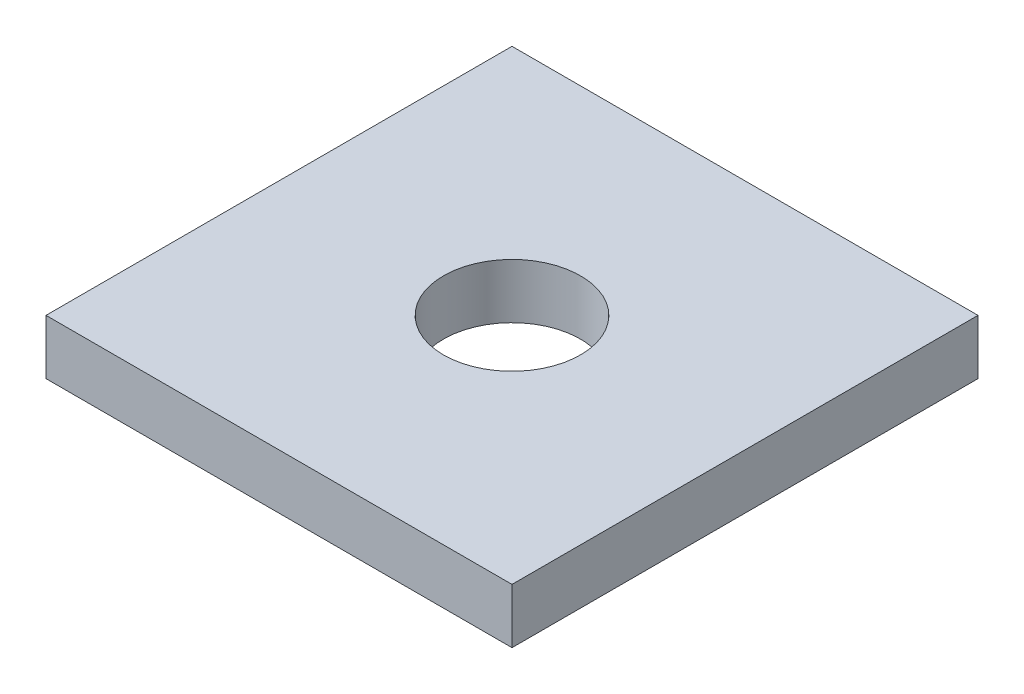
ISO-10303-21;
HEADER;
FILE_DESCRIPTION(('STEP AP214'),'2;1');
FILE_NAME('part.step','',(''),(''),'','','');
FILE_SCHEMA(('AUTOMOTIVE_DESIGN { 1 0 10303 214 1 1 1 1 }'));
ENDSEC;
DATA;
#1=APPLICATION_CONTEXT('core data for automotive mechanical design processes');
#2=APPLICATION_PROTOCOL_DEFINITION('international standard','automotive_design',2000,#1);
#3=PRODUCT_CONTEXT('',#1,'mechanical');
#4=PRODUCT('Part','Part','',(#3));
#5=PRODUCT_RELATED_PRODUCT_CATEGORY('part','',(#4));
#6=PRODUCT_DEFINITION_FORMATION('','',#4);
#7=PRODUCT_DEFINITION_CONTEXT('part definition',#1,'design');
#8=PRODUCT_DEFINITION('design','',#6,#7);
#9=PRODUCT_DEFINITION_SHAPE('','',#8);
#10=(LENGTH_UNIT() NAMED_UNIT(*) SI_UNIT(.MILLI.,.METRE.));
#11=(NAMED_UNIT(*) PLANE_ANGLE_UNIT() SI_UNIT($,.RADIAN.));
#12=(NAMED_UNIT(*) SI_UNIT($,.STERADIAN.) SOLID_ANGLE_UNIT());
#13=UNCERTAINTY_MEASURE_WITH_UNIT(LENGTH_MEASURE(1.E-05),#10,'distance_accuracy_value','');
#14=(GEOMETRIC_REPRESENTATION_CONTEXT(3) GLOBAL_UNCERTAINTY_ASSIGNED_CONTEXT((#13)) GLOBAL_UNIT_ASSIGNED_CONTEXT((#10,
#11,#12)) REPRESENTATION_CONTEXT('',''));
#15=CARTESIAN_POINT('',(0.,0.,0.));
#16=DIRECTION('',(0.,0.,1.));
#17=DIRECTION('',(1.,0.,0.));
#18=AXIS2_PLACEMENT_3D('',#15,#16,#17);
#19=CARTESIAN_POINT('',(170.,40.,-170.));
#20=DIRECTION('',(1.,0.,0.));
#21=DIRECTION('',(0.,0.,-1.));
#22=AXIS2_PLACEMENT_3D('',#19,#20,#21);
#23=PLANE('',#22);
#24=DIRECTION('',(0.,0.,1.));
#25=VECTOR('',#24,1.);
#26=CARTESIAN_POINT('',(170.,0.,-170.));
#27=LINE('',#26,#25);
#28=CARTESIAN_POINT('',(170.,0.,-170.));
#29=VERTEX_POINT('',#28);
#30=CARTESIAN_POINT('',(170.,0.,170.));
#31=VERTEX_POINT('',#30);
#32=EDGE_CURVE('E99',#29,#31,#27,.T.);
#33=ORIENTED_EDGE('',*,*,#32,.F.);
#34=DIRECTION('',(0.,-1.,0.));
#35=VECTOR('',#34,1.);
#36=CARTESIAN_POINT('',(170.,40.,-170.));
#37=LINE('',#36,#35);
#38=CARTESIAN_POINT('',(170.,40.,-170.));
#39=VERTEX_POINT('',#38);
#40=EDGE_CURVE('E11',#39,#29,#37,.T.);
#41=ORIENTED_EDGE('',*,*,#40,.F.);
#42=DIRECTION('',(0.,0.,1.));
#43=VECTOR('',#42,1.);
#44=CARTESIAN_POINT('',(170.,40.,-170.));
#45=LINE('',#44,#43);
#46=CARTESIAN_POINT('',(170.,40.,170.));
#47=VERTEX_POINT('',#46);
#48=EDGE_CURVE('E93',#39,#47,#45,.T.);
#49=ORIENTED_EDGE('',*,*,#48,.T.);
#50=DIRECTION('',(0.,-1.,0.));
#51=VECTOR('',#50,1.);
#52=CARTESIAN_POINT('',(170.,40.,170.));
#53=LINE('',#52,#51);
#54=EDGE_CURVE('E36',#47,#31,#53,.T.);
#55=ORIENTED_EDGE('',*,*,#54,.T.);
#56=EDGE_LOOP('',(#33,#41,#49,#55));
#57=FACE_BOUND('',#56,.T.);
#58=ADVANCED_FACE('F33',(#57),#23,.T.);
#59=CARTESIAN_POINT('',(170.,40.,-170.));
#60=DIRECTION('',(0.,0.,1.));
#61=DIRECTION('',(1.,0.,0.));
#62=AXIS2_PLACEMENT_3D('',#59,#60,#61);
#63=PLANE('',#62);
#64=DIRECTION('',(-1.,0.,0.));
#65=VECTOR('',#64,1.);
#66=CARTESIAN_POINT('',(170.,0.,-170.));
#67=LINE('',#66,#65);
#68=CARTESIAN_POINT('',(-170.,0.,-170.));
#69=VERTEX_POINT('',#68);
#70=EDGE_CURVE('E66',#29,#69,#67,.T.);
#71=ORIENTED_EDGE('',*,*,#70,.T.);
#72=DIRECTION('',(0.,-1.,0.));
#73=VECTOR('',#72,1.);
#74=CARTESIAN_POINT('',(-170.,40.,-170.));
#75=LINE('',#74,#73);
#76=CARTESIAN_POINT('',(-170.,40.,-170.));
#77=VERTEX_POINT('',#76);
#78=EDGE_CURVE('E42',#77,#69,#75,.T.);
#79=ORIENTED_EDGE('',*,*,#78,.F.);
#80=DIRECTION('',(-1.,0.,0.));
#81=VECTOR('',#80,1.);
#82=CARTESIAN_POINT('',(170.,40.,-170.));
#83=LINE('',#82,#81);
#84=EDGE_CURVE('E83',#39,#77,#83,.T.);
#85=ORIENTED_EDGE('',*,*,#84,.F.);
#86=ORIENTED_EDGE('',*,*,#40,.T.);
#87=EDGE_LOOP('',(#71,#79,#85,#86));
#88=FACE_BOUND('',#87,.T.);
#89=ADVANCED_FACE('F110',(#88),#63,.F.);
#90=CARTESIAN_POINT('',(-170.,40.,-170.));
#91=DIRECTION('',(1.,0.,0.));
#92=DIRECTION('',(0.,0.,-1.));
#93=AXIS2_PLACEMENT_3D('',#90,#91,#92);
#94=PLANE('',#93);
#95=DIRECTION('',(0.,0.,1.));
#96=VECTOR('',#95,1.);
#97=CARTESIAN_POINT('',(-170.,0.,-170.));
#98=LINE('',#97,#96);
#99=CARTESIAN_POINT('',(-170.,0.,170.));
#100=VERTEX_POINT('',#99);
#101=EDGE_CURVE('E90',#69,#100,#98,.T.);
#102=ORIENTED_EDGE('',*,*,#101,.T.);
#103=DIRECTION('',(0.,-1.,0.));
#104=VECTOR('',#103,1.);
#105=CARTESIAN_POINT('',(-170.,40.,170.));
#106=LINE('',#105,#104);
#107=CARTESIAN_POINT('',(-170.,40.,170.));
#108=VERTEX_POINT('',#107);
#109=EDGE_CURVE('E87',#108,#100,#106,.T.);
#110=ORIENTED_EDGE('',*,*,#109,.F.);
#111=DIRECTION('',(0.,0.,1.));
#112=VECTOR('',#111,1.);
#113=CARTESIAN_POINT('',(-170.,40.,-170.));
#114=LINE('',#113,#112);
#115=EDGE_CURVE('E78',#77,#108,#114,.T.);
#116=ORIENTED_EDGE('',*,*,#115,.F.);
#117=ORIENTED_EDGE('',*,*,#78,.T.);
#118=EDGE_LOOP('',(#102,#110,#116,#117));
#119=FACE_BOUND('',#118,.T.);
#120=ADVANCED_FACE('F88',(#119),#94,.F.);
#121=CARTESIAN_POINT('',(170.,40.,170.));
#122=DIRECTION('',(0.,0.,1.));
#123=DIRECTION('',(1.,0.,0.));
#124=AXIS2_PLACEMENT_3D('',#121,#122,#123);
#125=PLANE('',#124);
#126=DIRECTION('',(-1.,0.,0.));
#127=VECTOR('',#126,1.);
#128=CARTESIAN_POINT('',(170.,0.,170.));
#129=LINE('',#128,#127);
#130=EDGE_CURVE('E102',#31,#100,#129,.T.);
#131=ORIENTED_EDGE('',*,*,#130,.F.);
#132=ORIENTED_EDGE('',*,*,#54,.F.);
#133=DIRECTION('',(-1.,0.,0.));
#134=VECTOR('',#133,1.);
#135=CARTESIAN_POINT('',(170.,40.,170.));
#136=LINE('',#135,#134);
#137=EDGE_CURVE('E82',#47,#108,#136,.T.);
#138=ORIENTED_EDGE('',*,*,#137,.T.);
#139=ORIENTED_EDGE('',*,*,#109,.T.);
#140=EDGE_LOOP('',(#131,#132,#138,#139));
#141=FACE_BOUND('',#140,.T.);
#142=ADVANCED_FACE('F92',(#141),#125,.T.);
#143=CARTESIAN_POINT('',(0.,40.,0.));
#144=DIRECTION('',(0.,-1.,0.));
#145=DIRECTION('',(0.,0.,-1.));
#146=AXIS2_PLACEMENT_3D('',#143,#144,#145);
#147=PLANE('',#146);
#148=CARTESIAN_POINT('',(0.,40.,0.));
#149=DIRECTION('',(0.,1.,0.));
#150=DIRECTION('',(0.,0.,1.));
#151=AXIS2_PLACEMENT_3D('',#148,#149,#150);
#152=CIRCLE('',#151,50.);
#153=CARTESIAN_POINT('',(0.,40.,50.));
#154=VERTEX_POINT('',#153);
#155=EDGE_CURVE('E142',#154,#154,#152,.T.);
#156=ORIENTED_EDGE('',*,*,#155,.F.);
#157=EDGE_LOOP('',(#156));
#158=FACE_BOUND('',#157,.T.);
#159=ORIENTED_EDGE('',*,*,#48,.F.);
#160=ORIENTED_EDGE('',*,*,#84,.T.);
#161=ORIENTED_EDGE('',*,*,#115,.T.);
#162=ORIENTED_EDGE('',*,*,#137,.F.);
#163=EDGE_LOOP('',(#159,#160,#161,#162));
#164=FACE_BOUND('',#163,.T.);
#165=ADVANCED_FACE('F81',(#158,#164),#147,.F.);
#166=CARTESIAN_POINT('',(0.,0.,0.));
#167=DIRECTION('',(0.,-1.,0.));
#168=DIRECTION('',(0.,0.,-1.));
#169=AXIS2_PLACEMENT_3D('',#166,#167,#168);
#170=PLANE('',#169);
#171=CARTESIAN_POINT('',(0.,0.,0.));
#172=DIRECTION('',(0.,1.,0.));
#173=DIRECTION('',(0.,0.,1.));
#174=AXIS2_PLACEMENT_3D('',#171,#172,#173);
#175=CIRCLE('',#174,50.);
#176=CARTESIAN_POINT('',(0.,0.,50.));
#177=VERTEX_POINT('',#176);
#178=EDGE_CURVE('E103',#177,#177,#175,.T.);
#179=ORIENTED_EDGE('',*,*,#178,.T.);
#180=EDGE_LOOP('',(#179));
#181=FACE_BOUND('',#180,.T.);
#182=ORIENTED_EDGE('',*,*,#32,.T.);
#183=ORIENTED_EDGE('',*,*,#130,.T.);
#184=ORIENTED_EDGE('',*,*,#101,.F.);
#185=ORIENTED_EDGE('',*,*,#70,.F.);
#186=EDGE_LOOP('',(#182,#183,#184,#185));
#187=FACE_BOUND('',#186,.T.);
#188=ADVANCED_FACE('F108',(#181,#187),#170,.T.);
#189=CARTESIAN_POINT('',(0.,0.,0.));
#190=DIRECTION('',(0.,1.,0.));
#191=DIRECTION('',(0.,0.,1.));
#192=AXIS2_PLACEMENT_3D('',#189,#190,#191);
#193=CYLINDRICAL_SURFACE('',#192,50.);
#194=ORIENTED_EDGE('',*,*,#178,.F.);
#195=EDGE_LOOP('',(#194));
#196=FACE_BOUND('',#195,.T.);
#197=ORIENTED_EDGE('',*,*,#155,.T.);
#198=EDGE_LOOP('',(#197));
#199=FACE_BOUND('',#198,.T.);
#200=ADVANCED_FACE('F129',(#196,#199),#193,.F.);
#201=CLOSED_SHELL('',(#58,#89,#120,#142,#165,#188,#200));
#202=MANIFOLD_SOLID_BREP('B2',#201);
#203=ADVANCED_BREP_SHAPE_REPRESENTATION('',(#18,#202),#14);
#204=SHAPE_DEFINITION_REPRESENTATION(#9,#203);
ENDSEC;
END-ISO-10303-21;
